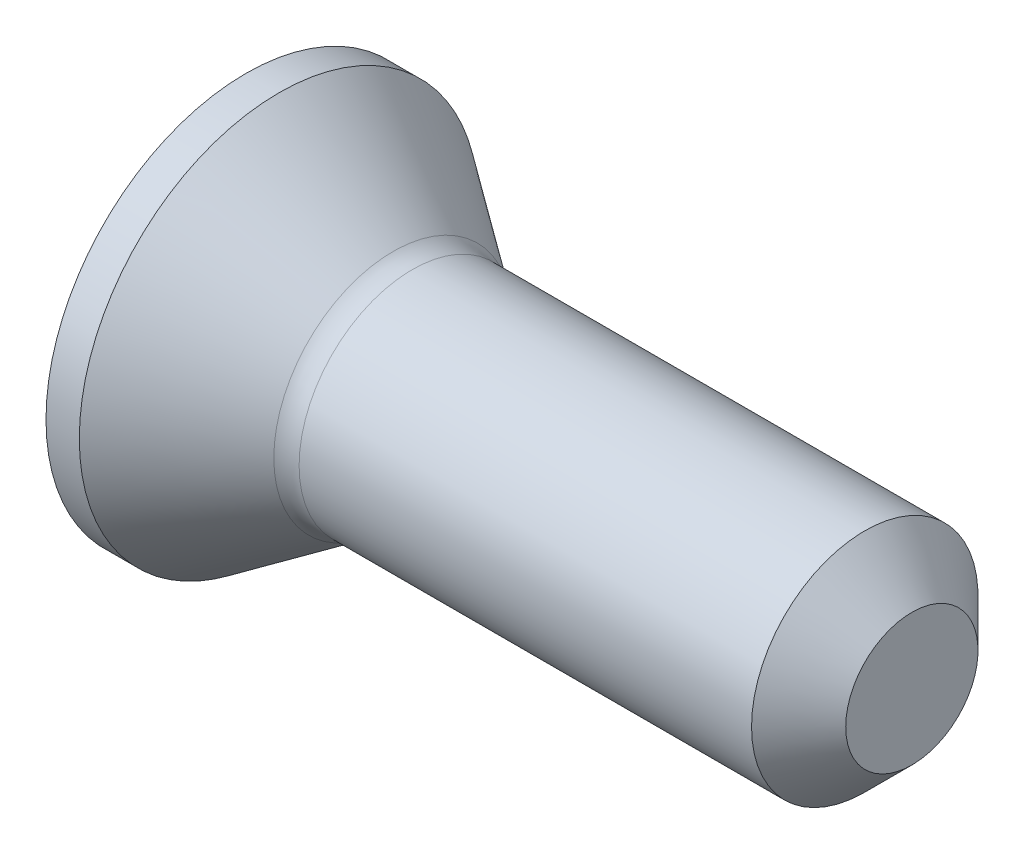
ISO-10303-21;
HEADER;
FILE_DESCRIPTION(('STEP AP214'),'2;1');
FILE_NAME('part.step','',(''),(''),'','','');
FILE_SCHEMA(('AUTOMOTIVE_DESIGN { 1 0 10303 214 1 1 1 1 }'));
ENDSEC;
DATA;
#1=APPLICATION_CONTEXT('core data for automotive mechanical design processes');
#2=APPLICATION_PROTOCOL_DEFINITION('international standard','automotive_design',2000,#1);
#3=PRODUCT_CONTEXT('',#1,'mechanical');
#4=PRODUCT('Part','Part','',(#3));
#5=PRODUCT_RELATED_PRODUCT_CATEGORY('part','',(#4));
#6=PRODUCT_DEFINITION_FORMATION('','',#4);
#7=PRODUCT_DEFINITION_CONTEXT('part definition',#1,'design');
#8=PRODUCT_DEFINITION('design','',#6,#7);
#9=PRODUCT_DEFINITION_SHAPE('','',#8);
#10=(LENGTH_UNIT() NAMED_UNIT(*) SI_UNIT(.MILLI.,.METRE.));
#11=(NAMED_UNIT(*) PLANE_ANGLE_UNIT() SI_UNIT($,.RADIAN.));
#12=(NAMED_UNIT(*) SI_UNIT($,.STERADIAN.) SOLID_ANGLE_UNIT());
#13=UNCERTAINTY_MEASURE_WITH_UNIT(LENGTH_MEASURE(1.E-05),#10,'distance_accuracy_value','');
#14=(GEOMETRIC_REPRESENTATION_CONTEXT(3) GLOBAL_UNCERTAINTY_ASSIGNED_CONTEXT((#13)) GLOBAL_UNIT_ASSIGNED_CONTEXT((#10,
#11,#12)) REPRESENTATION_CONTEXT('',''));
#15=CARTESIAN_POINT('',(0.,0.,0.));
#16=DIRECTION('',(0.,0.,1.));
#17=DIRECTION('',(1.,0.,0.));
#18=AXIS2_PLACEMENT_3D('',#15,#16,#17);
#19=CARTESIAN_POINT('',(5.,0.496446609406725,0.));
#20=DIRECTION('',(-1.,0.,0.));
#21=DIRECTION('',(0.,0.,1.));
#22=AXIS2_PLACEMENT_3D('',#19,#20,#21);
#23=PLANE('',#22);
#24=CARTESIAN_POINT('',(5.,0.,0.));
#25=DIRECTION('',(-1.,0.,0.));
#26=DIRECTION('',(0.,0.,1.));
#27=AXIS2_PLACEMENT_3D('',#24,#25,#26);
#28=CIRCLE('',#27,0.496446609406725);
#29=CARTESIAN_POINT('',(5.,0.,0.496446609406725));
#30=VERTEX_POINT('',#29);
#31=EDGE_CURVE('E11',#30,#30,#28,.T.);
#32=ORIENTED_EDGE('',*,*,#31,.F.);
#33=EDGE_LOOP('',(#32));
#34=FACE_BOUND('',#33,.T.);
#35=ADVANCED_FACE('F32',(#34),#23,.F.);
#36=CARTESIAN_POINT('',(5.,0.,0.));
#37=DIRECTION('',(-1.,0.,0.));
#38=DIRECTION('',(0.,0.,1.));
#39=AXIS2_PLACEMENT_3D('',#36,#37,#38);
#40=CONICAL_SURFACE('',#39,0.496446609406725,0.785398163397451);
#41=CARTESIAN_POINT('',(4.64644660940673,0.,0.));
#42=DIRECTION('',(-1.,0.,0.));
#43=DIRECTION('',(0.,0.,1.));
#44=AXIS2_PLACEMENT_3D('',#41,#42,#43);
#45=CIRCLE('',#44,0.85);
#46=CARTESIAN_POINT('',(4.64644660940673,0.,0.85));
#47=VERTEX_POINT('',#46);
#48=EDGE_CURVE('E39',#47,#47,#45,.T.);
#49=ORIENTED_EDGE('',*,*,#48,.F.);
#50=EDGE_LOOP('',(#49));
#51=FACE_BOUND('',#50,.T.);
#52=ORIENTED_EDGE('',*,*,#31,.T.);
#53=EDGE_LOOP('',(#52));
#54=FACE_BOUND('',#53,.T.);
#55=ADVANCED_FACE('F220',(#51,#54),#40,.T.);
#56=CARTESIAN_POINT('',(-3.97468528266504,0.,0.));
#57=DIRECTION('',(-1.,0.,0.));
#58=DIRECTION('',(0.,0.,1.));
#59=AXIS2_PLACEMENT_3D('',#56,#57,#58);
#60=CYLINDRICAL_SURFACE('',#59,0.85);
#61=CARTESIAN_POINT('',(1.25,0.,0.));
#62=DIRECTION('',(-1.,0.,0.));
#63=DIRECTION('',(0.,0.,1.));
#64=AXIS2_PLACEMENT_3D('',#61,#62,#63);
#65=CIRCLE('',#64,0.85);
#66=CARTESIAN_POINT('',(1.25,0.,0.85));
#67=VERTEX_POINT('',#66);
#68=EDGE_CURVE('E213',#67,#67,#65,.T.);
#69=ORIENTED_EDGE('',*,*,#68,.F.);
#70=EDGE_LOOP('',(#69));
#71=FACE_BOUND('',#70,.T.);
#72=ORIENTED_EDGE('',*,*,#48,.T.);
#73=EDGE_LOOP('',(#72));
#74=FACE_BOUND('',#73,.T.);
#75=ADVANCED_FACE('F218',(#71,#74),#60,.T.);
#76=CARTESIAN_POINT('',(1.25,0.,0.));
#77=DIRECTION('',(-1.,0.,0.));
#78=DIRECTION('',(0.,0.,1.));
#79=AXIS2_PLACEMENT_3D('',#76,#77,#78);
#80=TOROIDAL_SURFACE('',#79,1.1,0.25);
#81=CARTESIAN_POINT('',(1.10580893603553,0.,0.));
#82=DIRECTION('',(-1.,0.,0.));
#83=DIRECTION('',(0.,0.,1.));
#84=AXIS2_PLACEMENT_3D('',#81,#82,#83);
#85=CIRCLE('',#84,0.895772340088826);
#86=CARTESIAN_POINT('',(1.10580893603553,0.,0.895772340088826));
#87=VERTEX_POINT('',#86);
#88=EDGE_CURVE('E210',#87,#87,#85,.T.);
#89=ORIENTED_EDGE('',*,*,#88,.F.);
#90=EDGE_LOOP('',(#89));
#91=FACE_BOUND('',#90,.T.);
#92=ORIENTED_EDGE('',*,*,#68,.T.);
#93=EDGE_LOOP('',(#92));
#94=FACE_BOUND('',#93,.T.);
#95=ADVANCED_FACE('F238',(#91,#94),#80,.F.);
#96=CARTESIAN_POINT('',(1.10580893603553,0.,0.));
#97=DIRECTION('',(-1.,0.,0.));
#98=DIRECTION('',(0.,0.,1.));
#99=AXIS2_PLACEMENT_3D('',#96,#97,#98);
#100=CONICAL_SURFACE('',#99,0.895772340088826,0.614762173815364);
#101=CARTESIAN_POINT('',(0.25,0.,0.));
#102=DIRECTION('',(-1.,0.,0.));
#103=DIRECTION('',(0.,0.,1.));
#104=AXIS2_PLACEMENT_3D('',#101,#102,#103);
#105=CIRCLE('',#104,1.5);
#106=CARTESIAN_POINT('',(0.25,0.,1.5));
#107=VERTEX_POINT('',#106);
#108=EDGE_CURVE('E207',#107,#107,#105,.T.);
#109=ORIENTED_EDGE('',*,*,#108,.F.);
#110=EDGE_LOOP('',(#109));
#111=FACE_BOUND('',#110,.T.);
#112=ORIENTED_EDGE('',*,*,#88,.T.);
#113=EDGE_LOOP('',(#112));
#114=FACE_BOUND('',#113,.T.);
#115=ADVANCED_FACE('F246',(#111,#114),#100,.T.);
#116=CARTESIAN_POINT('',(-3.97468528266504,0.,0.));
#117=DIRECTION('',(-1.,0.,0.));
#118=DIRECTION('',(0.,0.,1.));
#119=AXIS2_PLACEMENT_3D('',#116,#117,#118);
#120=CYLINDRICAL_SURFACE('',#119,1.5);
#121=CARTESIAN_POINT('',(0.,0.,0.));
#122=DIRECTION('',(-1.,0.,0.));
#123=DIRECTION('',(0.,0.,1.));
#124=AXIS2_PLACEMENT_3D('',#121,#122,#123);
#125=CIRCLE('',#124,1.5);
#126=CARTESIAN_POINT('',(0.,0.,1.5));
#127=VERTEX_POINT('',#126);
#128=EDGE_CURVE('E187',#127,#127,#125,.T.);
#129=ORIENTED_EDGE('',*,*,#128,.F.);
#130=EDGE_LOOP('',(#129));
#131=FACE_BOUND('',#130,.T.);
#132=ORIENTED_EDGE('',*,*,#108,.T.);
#133=EDGE_LOOP('',(#132));
#134=FACE_BOUND('',#133,.T.);
#135=ADVANCED_FACE('F254',(#131,#134),#120,.T.);
#136=CARTESIAN_POINT('',(0.,0.,0.));
#137=DIRECTION('',(1.,0.,0.));
#138=DIRECTION('',(0.,0.,-1.));
#139=AXIS2_PLACEMENT_3D('',#136,#137,#138);
#140=PLANE('',#139);
#141=DIRECTION('',(0.,0.,-1.));
#142=VECTOR('',#141,1.);
#143=CARTESIAN_POINT('',(0.,0.75,-0.175));
#144=LINE('',#143,#142);
#145=CARTESIAN_POINT('',(0.,0.75,0.175));
#146=VERTEX_POINT('',#145);
#147=CARTESIAN_POINT('',(0.,0.75,-0.175));
#148=VERTEX_POINT('',#147);
#149=EDGE_CURVE('E156',#146,#148,#144,.T.);
#150=ORIENTED_EDGE('',*,*,#149,.F.);
#151=DIRECTION('',(0.,0.996194698091746,-0.0871557427476547));
#152=VECTOR('',#151,1.);
#153=CARTESIAN_POINT('',(0.,0.75,0.175));
#154=LINE('',#153,#152);
#155=CARTESIAN_POINT('',(0.,0.22125885603653,0.22125885603653));
#156=VERTEX_POINT('',#155);
#157=EDGE_CURVE('E46',#156,#146,#154,.T.);
#158=ORIENTED_EDGE('',*,*,#157,.F.);
#159=DIRECTION('',(0.,0.0871557427476547,-0.996194698091746));
#160=VECTOR('',#159,1.);
#161=CARTESIAN_POINT('',(0.,0.22125885603653,0.22125885603653));
#162=LINE('',#161,#160);
#163=CARTESIAN_POINT('',(0.,0.175,0.75));
#164=VERTEX_POINT('',#163);
#165=EDGE_CURVE('E183',#164,#156,#162,.T.);
#166=ORIENTED_EDGE('',*,*,#165,.F.);
#167=DIRECTION('',(0.,1.,0.));
#168=VECTOR('',#167,1.);
#169=CARTESIAN_POINT('',(0.,0.175,0.75));
#170=LINE('',#169,#168);
#171=CARTESIAN_POINT('',(0.,-0.175,0.75));
#172=VERTEX_POINT('',#171);
#173=EDGE_CURVE('E181',#172,#164,#170,.T.);
#174=ORIENTED_EDGE('',*,*,#173,.F.);
#175=DIRECTION('',(0.,0.0871557427476547,0.996194698091746));
#176=VECTOR('',#175,1.);
#177=CARTESIAN_POINT('',(0.,-0.22125885603653,0.22125885603653));
#178=LINE('',#177,#176);
#179=CARTESIAN_POINT('',(0.,-0.22125885603653,0.22125885603653));
#180=VERTEX_POINT('',#179);
#181=EDGE_CURVE('E130',#180,#172,#178,.T.);
#182=ORIENTED_EDGE('',*,*,#181,.F.);
#183=DIRECTION('',(0.,0.996194698091746,0.0871557427476547));
#184=VECTOR('',#183,1.);
#185=CARTESIAN_POINT('',(0.,-0.75,0.175));
#186=LINE('',#185,#184);
#187=CARTESIAN_POINT('',(0.,-0.75,0.175));
#188=VERTEX_POINT('',#187);
#189=EDGE_CURVE('E177',#188,#180,#186,.T.);
#190=ORIENTED_EDGE('',*,*,#189,.F.);
#191=DIRECTION('',(0.,0.,1.));
#192=VECTOR('',#191,1.);
#193=CARTESIAN_POINT('',(0.,-0.75,-0.175));
#194=LINE('',#193,#192);
#195=CARTESIAN_POINT('',(0.,-0.75,-0.175));
#196=VERTEX_POINT('',#195);
#197=EDGE_CURVE('E174',#196,#188,#194,.T.);
#198=ORIENTED_EDGE('',*,*,#197,.F.);
#199=DIRECTION('',(0.,-0.996194698091746,0.0871557427476547));
#200=VECTOR('',#199,1.);
#201=CARTESIAN_POINT('',(0.,-0.75,-0.175));
#202=LINE('',#201,#200);
#203=CARTESIAN_POINT('',(0.,-0.22125885603653,-0.22125885603653));
#204=VERTEX_POINT('',#203);
#205=EDGE_CURVE('E171',#204,#196,#202,.T.);
#206=ORIENTED_EDGE('',*,*,#205,.F.);
#207=DIRECTION('',(0.,-0.0871557427476547,0.996194698091746));
#208=VECTOR('',#207,1.);
#209=CARTESIAN_POINT('',(0.,-0.22125885603653,-0.22125885603653));
#210=LINE('',#209,#208);
#211=CARTESIAN_POINT('',(0.,-0.175,-0.75));
#212=VERTEX_POINT('',#211);
#213=EDGE_CURVE('E168',#212,#204,#210,.T.);
#214=ORIENTED_EDGE('',*,*,#213,.F.);
#215=DIRECTION('',(0.,-1.,0.));
#216=VECTOR('',#215,1.);
#217=CARTESIAN_POINT('',(0.,0.175,-0.75));
#218=LINE('',#217,#216);
#219=CARTESIAN_POINT('',(0.,0.175,-0.75));
#220=VERTEX_POINT('',#219);
#221=EDGE_CURVE('E165',#220,#212,#218,.T.);
#222=ORIENTED_EDGE('',*,*,#221,.F.);
#223=DIRECTION('',(0.,-0.0871557427476547,-0.996194698091746));
#224=VECTOR('',#223,1.);
#225=CARTESIAN_POINT('',(0.,0.22125885603653,-0.22125885603653));
#226=LINE('',#225,#224);
#227=CARTESIAN_POINT('',(0.,0.22125885603653,-0.22125885603653));
#228=VERTEX_POINT('',#227);
#229=EDGE_CURVE('E162',#228,#220,#226,.T.);
#230=ORIENTED_EDGE('',*,*,#229,.F.);
#231=DIRECTION('',(0.,-0.996194698091746,-0.0871557427476547));
#232=VECTOR('',#231,1.);
#233=CARTESIAN_POINT('',(0.,0.75,-0.175));
#234=LINE('',#233,#232);
#235=EDGE_CURVE('E159',#148,#228,#234,.T.);
#236=ORIENTED_EDGE('',*,*,#235,.F.);
#237=EDGE_LOOP('',(#150,#158,#166,#174,#182,#190,#198,#206,#214,#222,#230,#236));
#238=FACE_BOUND('',#237,.T.);
#239=ORIENTED_EDGE('',*,*,#128,.T.);
#240=EDGE_LOOP('',(#239));
#241=FACE_BOUND('',#240,.T.);
#242=ADVANCED_FACE('F262',(#238,#241),#140,.F.);
#243=CARTESIAN_POINT('',(0.5,0.75,0.175));
#244=DIRECTION('',(0.,0.0871557427476547,0.996194698091746));
#245=DIRECTION('',(0.,-0.996194698091746,0.0871557427476547));
#246=AXIS2_PLACEMENT_3D('',#243,#244,#245);
#247=PLANE('',#246);
#248=ORIENTED_EDGE('',*,*,#157,.T.);
#249=DIRECTION('',(-1.,0.,0.));
#250=VECTOR('',#249,1.);
#251=CARTESIAN_POINT('',(0.5,0.75,0.175));
#252=LINE('',#251,#250);
#253=CARTESIAN_POINT('',(0.5,0.75,0.175));
#254=VERTEX_POINT('',#253);
#255=EDGE_CURVE('E94',#254,#146,#252,.T.);
#256=ORIENTED_EDGE('',*,*,#255,.F.);
#257=DIRECTION('',(0.,0.996194698091746,-0.0871557427476547));
#258=VECTOR('',#257,1.);
#259=CARTESIAN_POINT('',(0.5,0.75,0.175));
#260=LINE('',#259,#258);
#261=CARTESIAN_POINT('',(0.5,0.22125885603653,0.22125885603653));
#262=VERTEX_POINT('',#261);
#263=EDGE_CURVE('E185',#262,#254,#260,.T.);
#264=ORIENTED_EDGE('',*,*,#263,.F.);
#265=DIRECTION('',(-1.,0.,0.));
#266=VECTOR('',#265,1.);
#267=CARTESIAN_POINT('',(0.5,0.22125885603653,0.22125885603653));
#268=LINE('',#267,#266);
#269=EDGE_CURVE('E54',#262,#156,#268,.T.);
#270=ORIENTED_EDGE('',*,*,#269,.T.);
#271=EDGE_LOOP('',(#248,#256,#264,#270));
#272=FACE_BOUND('',#271,.T.);
#273=ADVANCED_FACE('F270',(#272),#247,.F.);
#274=CARTESIAN_POINT('',(0.5,0.22125885603653,0.22125885603653));
#275=DIRECTION('',(0.,0.996194698091746,0.0871557427476547));
#276=DIRECTION('',(0.,-0.0871557427476547,0.996194698091746));
#277=AXIS2_PLACEMENT_3D('',#274,#275,#276);
#278=PLANE('',#277);
#279=ORIENTED_EDGE('',*,*,#165,.T.);
#280=ORIENTED_EDGE('',*,*,#269,.F.);
#281=DIRECTION('',(0.,0.0871557427476547,-0.996194698091746));
#282=VECTOR('',#281,1.);
#283=CARTESIAN_POINT('',(0.5,0.22125885603653,0.22125885603653));
#284=LINE('',#283,#282);
#285=CARTESIAN_POINT('',(0.5,0.175,0.75));
#286=VERTEX_POINT('',#285);
#287=EDGE_CURVE('E142',#286,#262,#284,.T.);
#288=ORIENTED_EDGE('',*,*,#287,.F.);
#289=DIRECTION('',(-1.,0.,0.));
#290=VECTOR('',#289,1.);
#291=CARTESIAN_POINT('',(0.5,0.175,0.75));
#292=LINE('',#291,#290);
#293=EDGE_CURVE('E134',#286,#164,#292,.T.);
#294=ORIENTED_EDGE('',*,*,#293,.T.);
#295=EDGE_LOOP('',(#279,#280,#288,#294));
#296=FACE_BOUND('',#295,.T.);
#297=ADVANCED_FACE('F278',(#296),#278,.F.);
#298=CARTESIAN_POINT('',(0.5,0.175,0.75));
#299=DIRECTION('',(0.,0.,1.));
#300=DIRECTION('',(1.,0.,0.));
#301=AXIS2_PLACEMENT_3D('',#298,#299,#300);
#302=PLANE('',#301);
#303=ORIENTED_EDGE('',*,*,#173,.T.);
#304=ORIENTED_EDGE('',*,*,#293,.F.);
#305=DIRECTION('',(0.,1.,0.));
#306=VECTOR('',#305,1.);
#307=CARTESIAN_POINT('',(0.5,0.175,0.75));
#308=LINE('',#307,#306);
#309=CARTESIAN_POINT('',(0.5,-0.175,0.75));
#310=VERTEX_POINT('',#309);
#311=EDGE_CURVE('E138',#310,#286,#308,.T.);
#312=ORIENTED_EDGE('',*,*,#311,.F.);
#313=DIRECTION('',(-1.,0.,0.));
#314=VECTOR('',#313,1.);
#315=CARTESIAN_POINT('',(0.5,-0.175,0.75));
#316=LINE('',#315,#314);
#317=EDGE_CURVE('E123',#310,#172,#316,.T.);
#318=ORIENTED_EDGE('',*,*,#317,.T.);
#319=EDGE_LOOP('',(#303,#304,#312,#318));
#320=FACE_BOUND('',#319,.T.);
#321=ADVANCED_FACE('F139',(#320),#302,.F.);
#322=CARTESIAN_POINT('',(0.5,-0.22125885603653,0.22125885603653));
#323=DIRECTION('',(0.,-0.996194698091746,0.0871557427476547));
#324=DIRECTION('',(0.,-0.0871557427476547,-0.996194698091746));
#325=AXIS2_PLACEMENT_3D('',#322,#323,#324);
#326=PLANE('',#325);
#327=ORIENTED_EDGE('',*,*,#181,.T.);
#328=ORIENTED_EDGE('',*,*,#317,.F.);
#329=DIRECTION('',(0.,0.0871557427476547,0.996194698091746));
#330=VECTOR('',#329,1.);
#331=CARTESIAN_POINT('',(0.5,-0.22125885603653,0.22125885603653));
#332=LINE('',#331,#330);
#333=CARTESIAN_POINT('',(0.5,-0.22125885603653,0.22125885603653));
#334=VERTEX_POINT('',#333);
#335=EDGE_CURVE('E127',#334,#310,#332,.T.);
#336=ORIENTED_EDGE('',*,*,#335,.F.);
#337=DIRECTION('',(-1.,0.,0.));
#338=VECTOR('',#337,1.);
#339=CARTESIAN_POINT('',(0.5,-0.22125885603653,0.22125885603653));
#340=LINE('',#339,#338);
#341=EDGE_CURVE('E135',#334,#180,#340,.T.);
#342=ORIENTED_EDGE('',*,*,#341,.T.);
#343=EDGE_LOOP('',(#327,#328,#336,#342));
#344=FACE_BOUND('',#343,.T.);
#345=ADVANCED_FACE('F125',(#344),#326,.F.);
#346=CARTESIAN_POINT('',(0.5,-0.75,0.175));
#347=DIRECTION('',(0.,-0.0871557427476547,0.996194698091746));
#348=DIRECTION('',(0.,-0.996194698091746,-0.0871557427476547));
#349=AXIS2_PLACEMENT_3D('',#346,#347,#348);
#350=PLANE('',#349);
#351=ORIENTED_EDGE('',*,*,#189,.T.);
#352=ORIENTED_EDGE('',*,*,#341,.F.);
#353=DIRECTION('',(0.,0.996194698091746,0.0871557427476547));
#354=VECTOR('',#353,1.);
#355=CARTESIAN_POINT('',(0.5,-0.75,0.175));
#356=LINE('',#355,#354);
#357=CARTESIAN_POINT('',(0.5,-0.75,0.175));
#358=VERTEX_POINT('',#357);
#359=EDGE_CURVE('E148',#358,#334,#356,.T.);
#360=ORIENTED_EDGE('',*,*,#359,.F.);
#361=DIRECTION('',(-1.,0.,0.));
#362=VECTOR('',#361,1.);
#363=CARTESIAN_POINT('',(0.5,-0.75,0.175));
#364=LINE('',#363,#362);
#365=EDGE_CURVE('E190',#358,#188,#364,.T.);
#366=ORIENTED_EDGE('',*,*,#365,.T.);
#367=EDGE_LOOP('',(#351,#352,#360,#366));
#368=FACE_BOUND('',#367,.T.);
#369=ADVANCED_FACE('F297',(#368),#350,.F.);
#370=CARTESIAN_POINT('',(0.5,-0.75,-0.175));
#371=DIRECTION('',(0.,-1.,0.));
#372=DIRECTION('',(0.,0.,-1.));
#373=AXIS2_PLACEMENT_3D('',#370,#371,#372);
#374=PLANE('',#373);
#375=ORIENTED_EDGE('',*,*,#197,.T.);
#376=ORIENTED_EDGE('',*,*,#365,.F.);
#377=DIRECTION('',(0.,0.,1.));
#378=VECTOR('',#377,1.);
#379=CARTESIAN_POINT('',(0.5,-0.75,-0.175));
#380=LINE('',#379,#378);
#381=CARTESIAN_POINT('',(0.5,-0.75,-0.175));
#382=VERTEX_POINT('',#381);
#383=EDGE_CURVE('E150',#382,#358,#380,.T.);
#384=ORIENTED_EDGE('',*,*,#383,.F.);
#385=DIRECTION('',(-1.,0.,0.));
#386=VECTOR('',#385,1.);
#387=CARTESIAN_POINT('',(0.5,-0.75,-0.175));
#388=LINE('',#387,#386);
#389=EDGE_CURVE('E192',#382,#196,#388,.T.);
#390=ORIENTED_EDGE('',*,*,#389,.T.);
#391=EDGE_LOOP('',(#375,#376,#384,#390));
#392=FACE_BOUND('',#391,.T.);
#393=ADVANCED_FACE('F304',(#392),#374,.F.);
#394=CARTESIAN_POINT('',(0.5,-0.75,-0.175));
#395=DIRECTION('',(0.,-0.0871557427476547,-0.996194698091746));
#396=DIRECTION('',(0.,0.996194698091746,-0.0871557427476547));
#397=AXIS2_PLACEMENT_3D('',#394,#395,#396);
#398=PLANE('',#397);
#399=ORIENTED_EDGE('',*,*,#205,.T.);
#400=ORIENTED_EDGE('',*,*,#389,.F.);
#401=DIRECTION('',(0.,-0.996194698091746,0.0871557427476547));
#402=VECTOR('',#401,1.);
#403=CARTESIAN_POINT('',(0.5,-0.75,-0.175));
#404=LINE('',#403,#402);
#405=CARTESIAN_POINT('',(0.5,-0.22125885603653,-0.22125885603653));
#406=VERTEX_POINT('',#405);
#407=EDGE_CURVE('E433',#406,#382,#404,.T.);
#408=ORIENTED_EDGE('',*,*,#407,.F.);
#409=DIRECTION('',(-1.,0.,0.));
#410=VECTOR('',#409,1.);
#411=CARTESIAN_POINT('',(0.5,-0.22125885603653,-0.22125885603653));
#412=LINE('',#411,#410);
#413=EDGE_CURVE('E194',#406,#204,#412,.T.);
#414=ORIENTED_EDGE('',*,*,#413,.T.);
#415=EDGE_LOOP('',(#399,#400,#408,#414));
#416=FACE_BOUND('',#415,.T.);
#417=ADVANCED_FACE('F312',(#416),#398,.F.);
#418=CARTESIAN_POINT('',(0.5,-0.22125885603653,-0.22125885603653));
#419=DIRECTION('',(0.,-0.996194698091746,-0.0871557427476547));
#420=DIRECTION('',(0.,0.0871557427476547,-0.996194698091746));
#421=AXIS2_PLACEMENT_3D('',#418,#419,#420);
#422=PLANE('',#421);
#423=ORIENTED_EDGE('',*,*,#213,.T.);
#424=ORIENTED_EDGE('',*,*,#413,.F.);
#425=DIRECTION('',(0.,-0.0871557427476547,0.996194698091746));
#426=VECTOR('',#425,1.);
#427=CARTESIAN_POINT('',(0.5,-0.22125885603653,-0.22125885603653));
#428=LINE('',#427,#426);
#429=CARTESIAN_POINT('',(0.5,-0.175,-0.75));
#430=VERTEX_POINT('',#429);
#431=EDGE_CURVE('E430',#430,#406,#428,.T.);
#432=ORIENTED_EDGE('',*,*,#431,.F.);
#433=DIRECTION('',(-1.,0.,0.));
#434=VECTOR('',#433,1.);
#435=CARTESIAN_POINT('',(0.5,-0.175,-0.75));
#436=LINE('',#435,#434);
#437=EDGE_CURVE('E196',#430,#212,#436,.T.);
#438=ORIENTED_EDGE('',*,*,#437,.T.);
#439=EDGE_LOOP('',(#423,#424,#432,#438));
#440=FACE_BOUND('',#439,.T.);
#441=ADVANCED_FACE('F320',(#440),#422,.F.);
#442=CARTESIAN_POINT('',(0.5,0.175,-0.75));
#443=DIRECTION('',(0.,0.,-1.));
#444=DIRECTION('',(-1.,0.,0.));
#445=AXIS2_PLACEMENT_3D('',#442,#443,#444);
#446=PLANE('',#445);
#447=ORIENTED_EDGE('',*,*,#221,.T.);
#448=ORIENTED_EDGE('',*,*,#437,.F.);
#449=DIRECTION('',(0.,-1.,0.));
#450=VECTOR('',#449,1.);
#451=CARTESIAN_POINT('',(0.5,0.175,-0.75));
#452=LINE('',#451,#450);
#453=CARTESIAN_POINT('',(0.5,0.175,-0.75));
#454=VERTEX_POINT('',#453);
#455=EDGE_CURVE('E427',#454,#430,#452,.T.);
#456=ORIENTED_EDGE('',*,*,#455,.F.);
#457=DIRECTION('',(-1.,0.,0.));
#458=VECTOR('',#457,1.);
#459=CARTESIAN_POINT('',(0.5,0.175,-0.75));
#460=LINE('',#459,#458);
#461=EDGE_CURVE('E198',#454,#220,#460,.T.);
#462=ORIENTED_EDGE('',*,*,#461,.T.);
#463=EDGE_LOOP('',(#447,#448,#456,#462));
#464=FACE_BOUND('',#463,.T.);
#465=ADVANCED_FACE('F328',(#464),#446,.F.);
#466=CARTESIAN_POINT('',(0.5,0.22125885603653,-0.22125885603653));
#467=DIRECTION('',(0.,0.996194698091746,-0.0871557427476547));
#468=DIRECTION('',(0.,0.0871557427476547,0.996194698091746));
#469=AXIS2_PLACEMENT_3D('',#466,#467,#468);
#470=PLANE('',#469);
#471=ORIENTED_EDGE('',*,*,#229,.T.);
#472=ORIENTED_EDGE('',*,*,#461,.F.);
#473=DIRECTION('',(0.,-0.0871557427476547,-0.996194698091746));
#474=VECTOR('',#473,1.);
#475=CARTESIAN_POINT('',(0.5,0.22125885603653,-0.22125885603653));
#476=LINE('',#475,#474);
#477=CARTESIAN_POINT('',(0.5,0.22125885603653,-0.22125885603653));
#478=VERTEX_POINT('',#477);
#479=EDGE_CURVE('E420',#478,#454,#476,.T.);
#480=ORIENTED_EDGE('',*,*,#479,.F.);
#481=DIRECTION('',(-1.,0.,0.));
#482=VECTOR('',#481,1.);
#483=CARTESIAN_POINT('',(0.5,0.22125885603653,-0.22125885603653));
#484=LINE('',#483,#482);
#485=EDGE_CURVE('E200',#478,#228,#484,.T.);
#486=ORIENTED_EDGE('',*,*,#485,.T.);
#487=EDGE_LOOP('',(#471,#472,#480,#486));
#488=FACE_BOUND('',#487,.T.);
#489=ADVANCED_FACE('F336',(#488),#470,.F.);
#490=CARTESIAN_POINT('',(0.5,0.75,-0.175));
#491=DIRECTION('',(0.,0.0871557427476547,-0.996194698091746));
#492=DIRECTION('',(0.,0.996194698091746,0.0871557427476547));
#493=AXIS2_PLACEMENT_3D('',#490,#491,#492);
#494=PLANE('',#493);
#495=ORIENTED_EDGE('',*,*,#235,.T.);
#496=ORIENTED_EDGE('',*,*,#485,.F.);
#497=DIRECTION('',(0.,-0.996194698091746,-0.0871557427476547));
#498=VECTOR('',#497,1.);
#499=CARTESIAN_POINT('',(0.5,0.75,-0.175));
#500=LINE('',#499,#498);
#501=CARTESIAN_POINT('',(0.5,0.75,-0.175));
#502=VERTEX_POINT('',#501);
#503=EDGE_CURVE('E417',#502,#478,#500,.T.);
#504=ORIENTED_EDGE('',*,*,#503,.F.);
#505=DIRECTION('',(-1.,0.,0.));
#506=VECTOR('',#505,1.);
#507=CARTESIAN_POINT('',(0.5,0.75,-0.175));
#508=LINE('',#507,#506);
#509=EDGE_CURVE('E202',#502,#148,#508,.T.);
#510=ORIENTED_EDGE('',*,*,#509,.T.);
#511=EDGE_LOOP('',(#495,#496,#504,#510));
#512=FACE_BOUND('',#511,.T.);
#513=ADVANCED_FACE('F344',(#512),#494,.F.);
#514=CARTESIAN_POINT('',(0.5,0.75,-0.175));
#515=DIRECTION('',(0.,1.,0.));
#516=DIRECTION('',(0.,0.,1.));
#517=AXIS2_PLACEMENT_3D('',#514,#515,#516);
#518=PLANE('',#517);
#519=ORIENTED_EDGE('',*,*,#149,.T.);
#520=ORIENTED_EDGE('',*,*,#509,.F.);
#521=DIRECTION('',(0.,0.,-1.));
#522=VECTOR('',#521,1.);
#523=CARTESIAN_POINT('',(0.5,0.75,-0.175));
#524=LINE('',#523,#522);
#525=EDGE_CURVE('E421',#254,#502,#524,.T.);
#526=ORIENTED_EDGE('',*,*,#525,.F.);
#527=ORIENTED_EDGE('',*,*,#255,.T.);
#528=EDGE_LOOP('',(#519,#520,#526,#527));
#529=FACE_BOUND('',#528,.T.);
#530=ADVANCED_FACE('F352',(#529),#518,.F.);
#531=CARTESIAN_POINT('',(0.5,0.,0.));
#532=DIRECTION('',(-1.,0.,0.));
#533=DIRECTION('',(0.,0.,1.));
#534=AXIS2_PLACEMENT_3D('',#531,#532,#533);
#535=PLANE('',#534);
#536=ORIENTED_EDGE('',*,*,#263,.T.);
#537=ORIENTED_EDGE('',*,*,#525,.T.);
#538=ORIENTED_EDGE('',*,*,#503,.T.);
#539=ORIENTED_EDGE('',*,*,#479,.T.);
#540=ORIENTED_EDGE('',*,*,#455,.T.);
#541=ORIENTED_EDGE('',*,*,#431,.T.);
#542=ORIENTED_EDGE('',*,*,#407,.T.);
#543=ORIENTED_EDGE('',*,*,#383,.T.);
#544=ORIENTED_EDGE('',*,*,#359,.T.);
#545=ORIENTED_EDGE('',*,*,#335,.T.);
#546=ORIENTED_EDGE('',*,*,#311,.T.);
#547=ORIENTED_EDGE('',*,*,#287,.T.);
#548=EDGE_LOOP('',(#536,#537,#538,#539,#540,#541,#542,#543,#544,#545,#546,#547));
#549=FACE_BOUND('',#548,.T.);
#550=ADVANCED_FACE('F145',(#549),#535,.T.);
#551=CLOSED_SHELL('',(#35,#55,#75,#95,#115,#135,#242,#273,#297,#321,#345,#369,#393,#417,#441,
#465,#489,#513,#530,#550));
#552=MANIFOLD_SOLID_BREP('B2',#551);
#553=ADVANCED_BREP_SHAPE_REPRESENTATION('',(#18,#552),#14);
#554=SHAPE_DEFINITION_REPRESENTATION(#9,#553);
ENDSEC;
END-ISO-10303-21;
